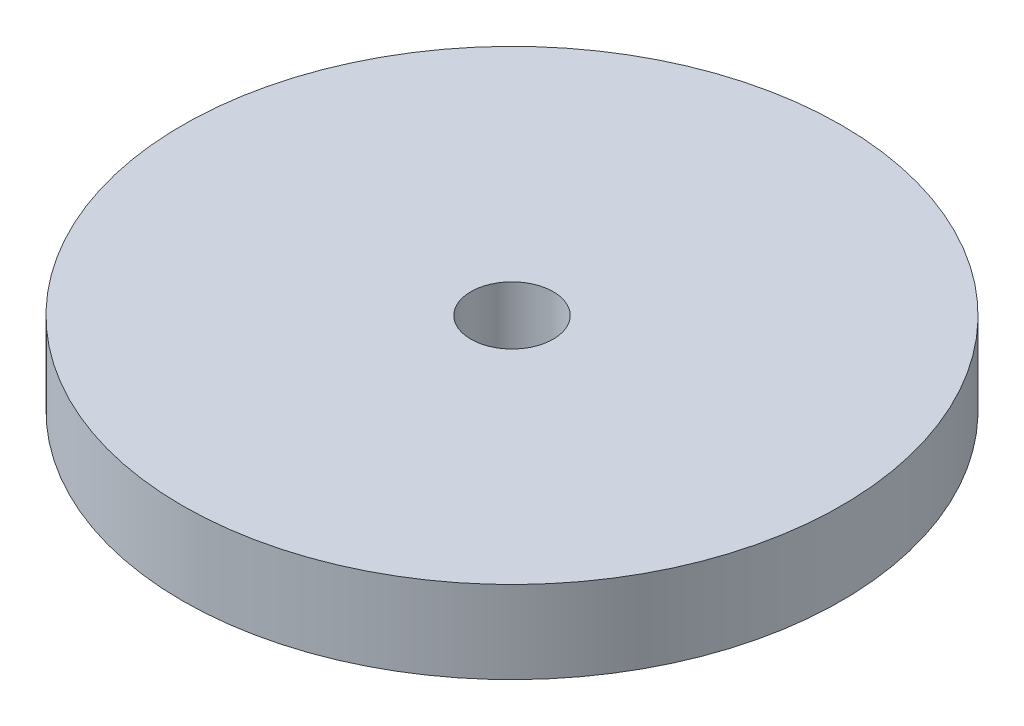
ISO-10303-21;
HEADER;
FILE_DESCRIPTION(('STEP AP214'),'2;1');
FILE_NAME('part.step','',(''),(''),'','','');
FILE_SCHEMA(('AUTOMOTIVE_DESIGN { 1 0 10303 214 1 1 1 1 }'));
ENDSEC;
DATA;
#1=APPLICATION_CONTEXT('core data for automotive mechanical design processes');
#2=APPLICATION_PROTOCOL_DEFINITION('international standard','automotive_design',2000,#1);
#3=PRODUCT_CONTEXT('',#1,'mechanical');
#4=PRODUCT('Part','Part','',(#3));
#5=PRODUCT_RELATED_PRODUCT_CATEGORY('part','',(#4));
#6=PRODUCT_DEFINITION_FORMATION('','',#4);
#7=PRODUCT_DEFINITION_CONTEXT('part definition',#1,'design');
#8=PRODUCT_DEFINITION('design','',#6,#7);
#9=PRODUCT_DEFINITION_SHAPE('','',#8);
#10=(LENGTH_UNIT() NAMED_UNIT(*) SI_UNIT(.MILLI.,.METRE.));
#11=(NAMED_UNIT(*) PLANE_ANGLE_UNIT() SI_UNIT($,.RADIAN.));
#12=(NAMED_UNIT(*) SI_UNIT($,.STERADIAN.) SOLID_ANGLE_UNIT());
#13=UNCERTAINTY_MEASURE_WITH_UNIT(LENGTH_MEASURE(1.E-05),#10,'distance_accuracy_value','');
#14=(GEOMETRIC_REPRESENTATION_CONTEXT(3) GLOBAL_UNCERTAINTY_ASSIGNED_CONTEXT((#13)) GLOBAL_UNIT_ASSIGNED_CONTEXT((#10,
#11,#12)) REPRESENTATION_CONTEXT('',''));
#15=CARTESIAN_POINT('',(0.,0.,0.));
#16=DIRECTION('',(0.,0.,1.));
#17=DIRECTION('',(1.,0.,0.));
#18=AXIS2_PLACEMENT_3D('',#15,#16,#17);
#19=CARTESIAN_POINT('',(0.,6.35,0.));
#20=DIRECTION('',(0.,1.,0.));
#21=DIRECTION('',(0.,0.,1.));
#22=AXIS2_PLACEMENT_3D('',#19,#20,#21);
#23=PLANE('',#22);
#24=CARTESIAN_POINT('',(0.,6.35,0.));
#25=DIRECTION('',(0.,1.,0.));
#26=DIRECTION('',(0.,0.,1.));
#27=AXIS2_PLACEMENT_3D('',#24,#25,#26);
#28=CIRCLE('',#27,25.4);
#29=CARTESIAN_POINT('',(0.,6.35,25.4));
#30=VERTEX_POINT('',#29);
#31=EDGE_CURVE('E10',#30,#30,#28,.T.);
#32=ORIENTED_EDGE('',*,*,#31,.T.);
#33=EDGE_LOOP('',(#32));
#34=FACE_BOUND('',#33,.T.);
#35=CARTESIAN_POINT('',(0.,6.35,0.));
#36=DIRECTION('',(0.,1.,0.));
#37=DIRECTION('',(0.,0.,1.));
#38=AXIS2_PLACEMENT_3D('',#35,#36,#37);
#39=CIRCLE('',#38,3.175);
#40=CARTESIAN_POINT('',(0.,6.35,3.175));
#41=VERTEX_POINT('',#40);
#42=EDGE_CURVE('E42',#41,#41,#39,.T.);
#43=ORIENTED_EDGE('',*,*,#42,.F.);
#44=EDGE_LOOP('',(#43));
#45=FACE_BOUND('',#44,.T.);
#46=ADVANCED_FACE('F31',(#34,#45),#23,.T.);
#47=CARTESIAN_POINT('',(0.,0.,0.));
#48=DIRECTION('',(0.,1.,0.));
#49=DIRECTION('',(0.,0.,1.));
#50=AXIS2_PLACEMENT_3D('',#47,#48,#49);
#51=PLANE('',#50);
#52=CARTESIAN_POINT('',(0.,0.,0.));
#53=DIRECTION('',(0.,1.,0.));
#54=DIRECTION('',(0.,0.,1.));
#55=AXIS2_PLACEMENT_3D('',#52,#53,#54);
#56=CIRCLE('',#55,25.4);
#57=CARTESIAN_POINT('',(0.,0.,25.4));
#58=VERTEX_POINT('',#57);
#59=EDGE_CURVE('E35',#58,#58,#56,.T.);
#60=ORIENTED_EDGE('',*,*,#59,.F.);
#61=EDGE_LOOP('',(#60));
#62=FACE_BOUND('',#61,.T.);
#63=CARTESIAN_POINT('',(0.,0.,0.));
#64=DIRECTION('',(0.,1.,0.));
#65=DIRECTION('',(0.,0.,1.));
#66=AXIS2_PLACEMENT_3D('',#63,#64,#65);
#67=CIRCLE('',#66,3.175);
#68=CARTESIAN_POINT('',(0.,0.,3.175));
#69=VERTEX_POINT('',#68);
#70=EDGE_CURVE('E44',#69,#69,#67,.T.);
#71=ORIENTED_EDGE('',*,*,#70,.T.);
#72=EDGE_LOOP('',(#71));
#73=FACE_BOUND('',#72,.T.);
#74=ADVANCED_FACE('F54',(#62,#73),#51,.F.);
#75=CARTESIAN_POINT('',(0.,6.35,0.));
#76=DIRECTION('',(0.,-1.,0.));
#77=DIRECTION('',(0.,0.,-1.));
#78=AXIS2_PLACEMENT_3D('',#75,#76,#77);
#79=CYLINDRICAL_SURFACE('',#78,25.4);
#80=ORIENTED_EDGE('',*,*,#31,.F.);
#81=EDGE_LOOP('',(#80));
#82=FACE_BOUND('',#81,.T.);
#83=ORIENTED_EDGE('',*,*,#59,.T.);
#84=EDGE_LOOP('',(#83));
#85=FACE_BOUND('',#84,.T.);
#86=ADVANCED_FACE('F33',(#82,#85),#79,.T.);
#87=CARTESIAN_POINT('',(0.,6.35,0.));
#88=DIRECTION('',(0.,-1.,0.));
#89=DIRECTION('',(0.,0.,-1.));
#90=AXIS2_PLACEMENT_3D('',#87,#88,#89);
#91=CYLINDRICAL_SURFACE('',#90,3.175);
#92=ORIENTED_EDGE('',*,*,#42,.T.);
#93=EDGE_LOOP('',(#92));
#94=FACE_BOUND('',#93,.T.);
#95=ORIENTED_EDGE('',*,*,#70,.F.);
#96=EDGE_LOOP('',(#95));
#97=FACE_BOUND('',#96,.T.);
#98=ADVANCED_FACE('F50',(#94,#97),#91,.F.);
#99=CLOSED_SHELL('',(#46,#74,#86,#98));
#100=MANIFOLD_SOLID_BREP('B2',#99);
#101=ADVANCED_BREP_SHAPE_REPRESENTATION('',(#18,#100),#14);
#102=SHAPE_DEFINITION_REPRESENTATION(#9,#101);
ENDSEC;
END-ISO-10303-21;
